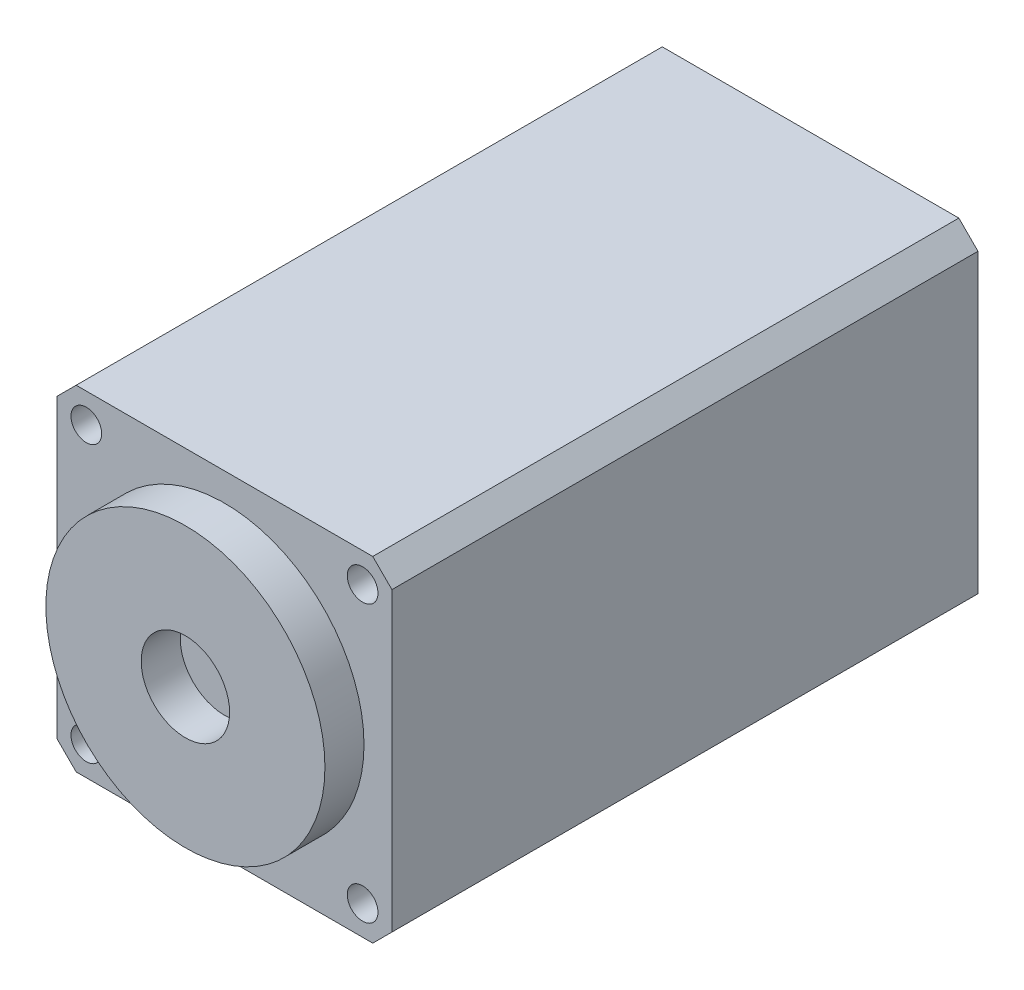
ISO-10303-21;
HEADER;
FILE_DESCRIPTION(('STEP AP214'),'2;1');
FILE_NAME('part.step','',(''),(''),'','','');
FILE_SCHEMA(('AUTOMOTIVE_DESIGN { 1 0 10303 214 1 1 1 1 }'));
ENDSEC;
DATA;
#1=APPLICATION_CONTEXT('core data for automotive mechanical design processes');
#2=APPLICATION_PROTOCOL_DEFINITION('international standard','automotive_design',2000,#1);
#3=PRODUCT_CONTEXT('',#1,'mechanical');
#4=PRODUCT('Part','Part','',(#3));
#5=PRODUCT_RELATED_PRODUCT_CATEGORY('part','',(#4));
#6=PRODUCT_DEFINITION_FORMATION('','',#4);
#7=PRODUCT_DEFINITION_CONTEXT('part definition',#1,'design');
#8=PRODUCT_DEFINITION('design','',#6,#7);
#9=PRODUCT_DEFINITION_SHAPE('','',#8);
#10=(LENGTH_UNIT() NAMED_UNIT(*) SI_UNIT(.MILLI.,.METRE.));
#11=(NAMED_UNIT(*) PLANE_ANGLE_UNIT() SI_UNIT($,.RADIAN.));
#12=(NAMED_UNIT(*) SI_UNIT($,.STERADIAN.) SOLID_ANGLE_UNIT());
#13=UNCERTAINTY_MEASURE_WITH_UNIT(LENGTH_MEASURE(1.E-05),#10,'distance_accuracy_value','');
#14=(GEOMETRIC_REPRESENTATION_CONTEXT(3) GLOBAL_UNCERTAINTY_ASSIGNED_CONTEXT((#13)) GLOBAL_UNIT_ASSIGNED_CONTEXT((#10,
#11,#12)) REPRESENTATION_CONTEXT('',''));
#15=CARTESIAN_POINT('',(0.,0.,0.));
#16=DIRECTION('',(0.,0.,1.));
#17=DIRECTION('',(1.,0.,0.));
#18=AXIS2_PLACEMENT_3D('',#15,#16,#17);
#19=CARTESIAN_POINT('',(0.,30.,105.));
#20=DIRECTION('',(0.,1.,0.));
#21=DIRECTION('',(-1.,0.,0.));
#22=AXIS2_PLACEMENT_3D('',#19,#20,#21);
#23=PLANE('',#22);
#24=DIRECTION('',(1.,0.,0.));
#25=VECTOR('',#24,1.);
#26=CARTESIAN_POINT('',(0.,30.,0.));
#27=LINE('',#26,#25);
#28=CARTESIAN_POINT('',(-26.5685424949238,30.,0.));
#29=VERTEX_POINT('',#28);
#30=CARTESIAN_POINT('',(26.5685424949238,30.,0.));
#31=VERTEX_POINT('',#30);
#32=EDGE_CURVE('E151',#29,#31,#27,.T.);
#33=ORIENTED_EDGE('',*,*,#32,.F.);
#34=DIRECTION('',(0.,0.,-1.));
#35=VECTOR('',#34,1.);
#36=CARTESIAN_POINT('',(-26.5685424949238,30.,105.));
#37=LINE('',#36,#35);
#38=CARTESIAN_POINT('',(-26.5685424949238,30.,105.));
#39=VERTEX_POINT('',#38);
#40=EDGE_CURVE('E47',#39,#29,#37,.T.);
#41=ORIENTED_EDGE('',*,*,#40,.F.);
#42=DIRECTION('',(1.,0.,0.));
#43=VECTOR('',#42,1.);
#44=CARTESIAN_POINT('',(0.,30.,105.));
#45=LINE('',#44,#43);
#46=CARTESIAN_POINT('',(26.5685424949238,30.,105.));
#47=VERTEX_POINT('',#46);
#48=EDGE_CURVE('E297',#39,#47,#45,.T.);
#49=ORIENTED_EDGE('',*,*,#48,.T.);
#50=DIRECTION('',(0.,0.,-1.));
#51=VECTOR('',#50,1.);
#52=CARTESIAN_POINT('',(26.5685424949238,30.,105.));
#53=LINE('',#52,#51);
#54=EDGE_CURVE('E55',#47,#31,#53,.T.);
#55=ORIENTED_EDGE('',*,*,#54,.T.);
#56=EDGE_LOOP('',(#33,#41,#49,#55));
#57=FACE_BOUND('',#56,.T.);
#58=ADVANCED_FACE('F38',(#57),#23,.T.);
#59=CARTESIAN_POINT('',(-28.2842712474619,28.2842712474619,105.));
#60=DIRECTION('',(0.707106781186546,-0.707106781186549,0.));
#61=DIRECTION('',(0.707106781186549,0.707106781186546,0.));
#62=AXIS2_PLACEMENT_3D('',#59,#60,#61);
#63=PLANE('',#62);
#64=DIRECTION('',(-0.707106781186549,-0.707106781186546,0.));
#65=VECTOR('',#64,1.);
#66=CARTESIAN_POINT('',(-28.2842712474619,28.2842712474619,0.));
#67=LINE('',#66,#65);
#68=CARTESIAN_POINT('',(-30.,26.5685424949238,0.));
#69=VERTEX_POINT('',#68);
#70=EDGE_CURVE('E145',#29,#69,#67,.T.);
#71=ORIENTED_EDGE('',*,*,#70,.T.);
#72=DIRECTION('',(0.,0.,-1.));
#73=VECTOR('',#72,1.);
#74=CARTESIAN_POINT('',(-30.,26.5685424949238,105.));
#75=LINE('',#74,#73);
#76=CARTESIAN_POINT('',(-30.,26.5685424949238,105.));
#77=VERTEX_POINT('',#76);
#78=EDGE_CURVE('E139',#77,#69,#75,.T.);
#79=ORIENTED_EDGE('',*,*,#78,.F.);
#80=DIRECTION('',(-0.707106781186549,-0.707106781186546,0.));
#81=VECTOR('',#80,1.);
#82=CARTESIAN_POINT('',(-28.2842712474619,28.2842712474619,105.));
#83=LINE('',#82,#81);
#84=EDGE_CURVE('E147',#39,#77,#83,.T.);
#85=ORIENTED_EDGE('',*,*,#84,.F.);
#86=ORIENTED_EDGE('',*,*,#40,.T.);
#87=EDGE_LOOP('',(#71,#79,#85,#86));
#88=FACE_BOUND('',#87,.T.);
#89=ADVANCED_FACE('F143',(#88),#63,.F.);
#90=CARTESIAN_POINT('',(-30.,0.,105.));
#91=DIRECTION('',(-1.,0.,0.));
#92=DIRECTION('',(0.,0.,1.));
#93=AXIS2_PLACEMENT_3D('',#90,#91,#92);
#94=PLANE('',#93);
#95=DIRECTION('',(0.,1.,0.));
#96=VECTOR('',#95,1.);
#97=CARTESIAN_POINT('',(-30.,0.,0.));
#98=LINE('',#97,#96);
#99=CARTESIAN_POINT('',(-30.,-26.5685424949238,0.));
#100=VERTEX_POINT('',#99);
#101=EDGE_CURVE('E154',#100,#69,#98,.T.);
#102=ORIENTED_EDGE('',*,*,#101,.F.);
#103=DIRECTION('',(0.,0.,-1.));
#104=VECTOR('',#103,1.);
#105=CARTESIAN_POINT('',(-30.,-26.5685424949238,105.));
#106=LINE('',#105,#104);
#107=CARTESIAN_POINT('',(-30.,-26.5685424949238,105.));
#108=VERTEX_POINT('',#107);
#109=EDGE_CURVE('E137',#108,#100,#106,.T.);
#110=ORIENTED_EDGE('',*,*,#109,.F.);
#111=DIRECTION('',(0.,1.,0.));
#112=VECTOR('',#111,1.);
#113=CARTESIAN_POINT('',(-30.,0.,105.));
#114=LINE('',#113,#112);
#115=EDGE_CURVE('E300',#108,#77,#114,.T.);
#116=ORIENTED_EDGE('',*,*,#115,.T.);
#117=ORIENTED_EDGE('',*,*,#78,.T.);
#118=EDGE_LOOP('',(#102,#110,#116,#117));
#119=FACE_BOUND('',#118,.T.);
#120=ADVANCED_FACE('F207',(#119),#94,.T.);
#121=CARTESIAN_POINT('',(-28.2842712474619,-28.2842712474619,105.));
#122=DIRECTION('',(0.707106781186548,0.707106781186548,0.));
#123=DIRECTION('',(-0.707106781186548,0.707106781186548,0.));
#124=AXIS2_PLACEMENT_3D('',#121,#122,#123);
#125=PLANE('',#124);
#126=DIRECTION('',(0.707106781186548,-0.707106781186548,0.));
#127=VECTOR('',#126,1.);
#128=CARTESIAN_POINT('',(-28.2842712474619,-28.2842712474619,0.));
#129=LINE('',#128,#127);
#130=CARTESIAN_POINT('',(-26.5685424949238,-30.,0.));
#131=VERTEX_POINT('',#130);
#132=EDGE_CURVE('E164',#100,#131,#129,.T.);
#133=ORIENTED_EDGE('',*,*,#132,.T.);
#134=DIRECTION('',(0.,0.,-1.));
#135=VECTOR('',#134,1.);
#136=CARTESIAN_POINT('',(-26.5685424949238,-30.,105.));
#137=LINE('',#136,#135);
#138=CARTESIAN_POINT('',(-26.5685424949238,-30.,105.));
#139=VERTEX_POINT('',#138);
#140=EDGE_CURVE('E130',#139,#131,#137,.T.);
#141=ORIENTED_EDGE('',*,*,#140,.F.);
#142=DIRECTION('',(0.707106781186548,-0.707106781186548,0.));
#143=VECTOR('',#142,1.);
#144=CARTESIAN_POINT('',(-28.2842712474619,-28.2842712474619,105.));
#145=LINE('',#144,#143);
#146=EDGE_CURVE('E303',#108,#139,#145,.T.);
#147=ORIENTED_EDGE('',*,*,#146,.F.);
#148=ORIENTED_EDGE('',*,*,#109,.T.);
#149=EDGE_LOOP('',(#133,#141,#147,#148));
#150=FACE_BOUND('',#149,.T.);
#151=ADVANCED_FACE('F212',(#150),#125,.F.);
#152=CARTESIAN_POINT('',(0.,-30.,105.));
#153=DIRECTION('',(0.,1.,0.));
#154=DIRECTION('',(-1.,0.,0.));
#155=AXIS2_PLACEMENT_3D('',#152,#153,#154);
#156=PLANE('',#155);
#157=DIRECTION('',(1.,0.,0.));
#158=VECTOR('',#157,1.);
#159=CARTESIAN_POINT('',(0.,-30.,0.));
#160=LINE('',#159,#158);
#161=CARTESIAN_POINT('',(26.5685424949238,-30.,0.));
#162=VERTEX_POINT('',#161);
#163=EDGE_CURVE('E167',#131,#162,#160,.T.);
#164=ORIENTED_EDGE('',*,*,#163,.T.);
#165=DIRECTION('',(0.,0.,-1.));
#166=VECTOR('',#165,1.);
#167=CARTESIAN_POINT('',(26.5685424949238,-30.,105.));
#168=LINE('',#167,#166);
#169=CARTESIAN_POINT('',(26.5685424949238,-30.,105.));
#170=VERTEX_POINT('',#169);
#171=EDGE_CURVE('E128',#170,#162,#168,.T.);
#172=ORIENTED_EDGE('',*,*,#171,.F.);
#173=DIRECTION('',(1.,0.,0.));
#174=VECTOR('',#173,1.);
#175=CARTESIAN_POINT('',(0.,-30.,105.));
#176=LINE('',#175,#174);
#177=EDGE_CURVE('E121',#139,#170,#176,.T.);
#178=ORIENTED_EDGE('',*,*,#177,.F.);
#179=ORIENTED_EDGE('',*,*,#140,.T.);
#180=EDGE_LOOP('',(#164,#172,#178,#179));
#181=FACE_BOUND('',#180,.T.);
#182=ADVANCED_FACE('F216',(#181),#156,.F.);
#183=CARTESIAN_POINT('',(28.2842712474619,-28.2842712474619,105.));
#184=DIRECTION('',(-0.707106781186547,0.707106781186548,0.));
#185=DIRECTION('',(-0.707106781186548,-0.707106781186547,0.));
#186=AXIS2_PLACEMENT_3D('',#183,#184,#185);
#187=PLANE('',#186);
#188=DIRECTION('',(0.707106781186548,0.707106781186547,0.));
#189=VECTOR('',#188,1.);
#190=CARTESIAN_POINT('',(28.2842712474619,-28.2842712474619,0.));
#191=LINE('',#190,#189);
#192=CARTESIAN_POINT('',(30.,-26.5685424949238,0.));
#193=VERTEX_POINT('',#192);
#194=EDGE_CURVE('E127',#162,#193,#191,.T.);
#195=ORIENTED_EDGE('',*,*,#194,.T.);
#196=DIRECTION('',(0.,0.,-1.));
#197=VECTOR('',#196,1.);
#198=CARTESIAN_POINT('',(30.,-26.5685424949238,105.));
#199=LINE('',#198,#197);
#200=CARTESIAN_POINT('',(30.,-26.5685424949238,105.));
#201=VERTEX_POINT('',#200);
#202=EDGE_CURVE('E110',#201,#193,#199,.T.);
#203=ORIENTED_EDGE('',*,*,#202,.F.);
#204=DIRECTION('',(0.707106781186548,0.707106781186547,0.));
#205=VECTOR('',#204,1.);
#206=CARTESIAN_POINT('',(28.2842712474619,-28.2842712474619,105.));
#207=LINE('',#206,#205);
#208=EDGE_CURVE('E115',#170,#201,#207,.T.);
#209=ORIENTED_EDGE('',*,*,#208,.F.);
#210=ORIENTED_EDGE('',*,*,#171,.T.);
#211=EDGE_LOOP('',(#195,#203,#209,#210));
#212=FACE_BOUND('',#211,.T.);
#213=ADVANCED_FACE('F126',(#212),#187,.F.);
#214=CARTESIAN_POINT('',(30.,0.,105.));
#215=DIRECTION('',(-1.,0.,0.));
#216=DIRECTION('',(0.,0.,1.));
#217=AXIS2_PLACEMENT_3D('',#214,#215,#216);
#218=PLANE('',#217);
#219=DIRECTION('',(0.,1.,0.));
#220=VECTOR('',#219,1.);
#221=CARTESIAN_POINT('',(30.,0.,0.));
#222=LINE('',#221,#220);
#223=CARTESIAN_POINT('',(30.,26.5685424949238,0.));
#224=VERTEX_POINT('',#223);
#225=EDGE_CURVE('E171',#193,#224,#222,.T.);
#226=ORIENTED_EDGE('',*,*,#225,.T.);
#227=DIRECTION('',(0.,0.,-1.));
#228=VECTOR('',#227,1.);
#229=CARTESIAN_POINT('',(30.,26.5685424949238,105.));
#230=LINE('',#229,#228);
#231=CARTESIAN_POINT('',(30.,26.5685424949238,105.));
#232=VERTEX_POINT('',#231);
#233=EDGE_CURVE('E82',#232,#224,#230,.T.);
#234=ORIENTED_EDGE('',*,*,#233,.F.);
#235=DIRECTION('',(0.,1.,0.));
#236=VECTOR('',#235,1.);
#237=CARTESIAN_POINT('',(30.,0.,105.));
#238=LINE('',#237,#236);
#239=EDGE_CURVE('E106',#201,#232,#238,.T.);
#240=ORIENTED_EDGE('',*,*,#239,.F.);
#241=ORIENTED_EDGE('',*,*,#202,.T.);
#242=EDGE_LOOP('',(#226,#234,#240,#241));
#243=FACE_BOUND('',#242,.T.);
#244=ADVANCED_FACE('F108',(#243),#218,.F.);
#245=CARTESIAN_POINT('',(-24.7487373415292,24.7487373415292,105.));
#246=DIRECTION('',(0.,0.,-1.));
#247=DIRECTION('',(-1.,0.,0.));
#248=AXIS2_PLACEMENT_3D('',#245,#246,#247);
#249=CYLINDRICAL_SURFACE('',#248,2.75);
#250=CARTESIAN_POINT('',(-24.7487373415292,24.7487373415292,105.));
#251=DIRECTION('',(0.,0.,1.));
#252=DIRECTION('',(1.,0.,0.));
#253=AXIS2_PLACEMENT_3D('',#250,#251,#252);
#254=CIRCLE('',#253,2.75);
#255=CARTESIAN_POINT('',(-21.9987373415292,24.7487373415292,105.));
#256=VERTEX_POINT('',#255);
#257=EDGE_CURVE('E294',#256,#256,#254,.T.);
#258=ORIENTED_EDGE('',*,*,#257,.T.);
#259=EDGE_LOOP('',(#258));
#260=FACE_BOUND('',#259,.T.);
#261=CARTESIAN_POINT('',(-24.7487373415292,24.7487373415292,0.));
#262=DIRECTION('',(0.,0.,1.));
#263=DIRECTION('',(1.,0.,0.));
#264=AXIS2_PLACEMENT_3D('',#261,#262,#263);
#265=CIRCLE('',#264,2.75);
#266=CARTESIAN_POINT('',(-21.9987373415292,24.7487373415292,0.));
#267=VERTEX_POINT('',#266);
#268=EDGE_CURVE('E156',#267,#267,#265,.T.);
#269=ORIENTED_EDGE('',*,*,#268,.F.);
#270=EDGE_LOOP('',(#269));
#271=FACE_BOUND('',#270,.T.);
#272=ADVANCED_FACE('F191',(#260,#271),#249,.F.);
#273=CARTESIAN_POINT('',(24.7487373415291,24.7487373415292,105.));
#274=DIRECTION('',(0.,0.,-1.));
#275=DIRECTION('',(-1.,0.,0.));
#276=AXIS2_PLACEMENT_3D('',#273,#274,#275);
#277=CYLINDRICAL_SURFACE('',#276,2.75);
#278=CARTESIAN_POINT('',(24.7487373415291,24.7487373415292,105.));
#279=DIRECTION('',(0.,0.,1.));
#280=DIRECTION('',(1.,0.,0.));
#281=AXIS2_PLACEMENT_3D('',#278,#279,#280);
#282=CIRCLE('',#281,2.75);
#283=CARTESIAN_POINT('',(27.4987373415291,24.7487373415292,105.));
#284=VERTEX_POINT('',#283);
#285=EDGE_CURVE('E292',#284,#284,#282,.T.);
#286=ORIENTED_EDGE('',*,*,#285,.T.);
#287=EDGE_LOOP('',(#286));
#288=FACE_BOUND('',#287,.T.);
#289=CARTESIAN_POINT('',(24.7487373415291,24.7487373415292,0.));
#290=DIRECTION('',(0.,0.,1.));
#291=DIRECTION('',(1.,0.,0.));
#292=AXIS2_PLACEMENT_3D('',#289,#290,#291);
#293=CIRCLE('',#292,2.75);
#294=CARTESIAN_POINT('',(27.4987373415291,24.7487373415292,0.));
#295=VERTEX_POINT('',#294);
#296=EDGE_CURVE('E159',#295,#295,#293,.T.);
#297=ORIENTED_EDGE('',*,*,#296,.F.);
#298=EDGE_LOOP('',(#297));
#299=FACE_BOUND('',#298,.T.);
#300=ADVANCED_FACE('F188',(#288,#299),#277,.F.);
#301=CARTESIAN_POINT('',(-24.7487373415292,-24.7487373415292,105.));
#302=DIRECTION('',(0.,0.,-1.));
#303=DIRECTION('',(-1.,0.,0.));
#304=AXIS2_PLACEMENT_3D('',#301,#302,#303);
#305=CYLINDRICAL_SURFACE('',#304,2.75);
#306=CARTESIAN_POINT('',(-24.7487373415292,-24.7487373415292,105.));
#307=DIRECTION('',(0.,0.,1.));
#308=DIRECTION('',(1.,0.,0.));
#309=AXIS2_PLACEMENT_3D('',#306,#307,#308);
#310=CIRCLE('',#309,2.75);
#311=CARTESIAN_POINT('',(-21.9987373415292,-24.7487373415292,105.));
#312=VERTEX_POINT('',#311);
#313=EDGE_CURVE('E289',#312,#312,#310,.T.);
#314=ORIENTED_EDGE('',*,*,#313,.T.);
#315=EDGE_LOOP('',(#314));
#316=FACE_BOUND('',#315,.T.);
#317=CARTESIAN_POINT('',(-24.7487373415292,-24.7487373415292,0.));
#318=DIRECTION('',(0.,0.,1.));
#319=DIRECTION('',(1.,0.,0.));
#320=AXIS2_PLACEMENT_3D('',#317,#318,#319);
#321=CIRCLE('',#320,2.75);
#322=CARTESIAN_POINT('',(-21.9987373415292,-24.7487373415292,0.));
#323=VERTEX_POINT('',#322);
#324=EDGE_CURVE('E180',#323,#323,#321,.T.);
#325=ORIENTED_EDGE('',*,*,#324,.F.);
#326=EDGE_LOOP('',(#325));
#327=FACE_BOUND('',#326,.T.);
#328=ADVANCED_FACE('F190',(#316,#327),#305,.F.);
#329=CARTESIAN_POINT('',(24.7487373415292,-24.7487373415292,105.));
#330=DIRECTION('',(0.,0.,-1.));
#331=DIRECTION('',(-1.,0.,0.));
#332=AXIS2_PLACEMENT_3D('',#329,#330,#331);
#333=CYLINDRICAL_SURFACE('',#332,2.75);
#334=CARTESIAN_POINT('',(24.7487373415292,-24.7487373415292,105.));
#335=DIRECTION('',(0.,0.,1.));
#336=DIRECTION('',(1.,0.,0.));
#337=AXIS2_PLACEMENT_3D('',#334,#335,#336);
#338=CIRCLE('',#337,2.75);
#339=CARTESIAN_POINT('',(27.4987373415292,-24.7487373415292,105.));
#340=VERTEX_POINT('',#339);
#341=EDGE_CURVE('E174',#340,#340,#338,.T.);
#342=ORIENTED_EDGE('',*,*,#341,.T.);
#343=EDGE_LOOP('',(#342));
#344=FACE_BOUND('',#343,.T.);
#345=CARTESIAN_POINT('',(24.7487373415292,-24.7487373415292,0.));
#346=DIRECTION('',(0.,0.,1.));
#347=DIRECTION('',(1.,0.,0.));
#348=AXIS2_PLACEMENT_3D('',#345,#346,#347);
#349=CIRCLE('',#348,2.75);
#350=CARTESIAN_POINT('',(27.4987373415292,-24.7487373415292,0.));
#351=VERTEX_POINT('',#350);
#352=EDGE_CURVE('E177',#351,#351,#349,.T.);
#353=ORIENTED_EDGE('',*,*,#352,.F.);
#354=EDGE_LOOP('',(#353));
#355=FACE_BOUND('',#354,.T.);
#356=ADVANCED_FACE('F40',(#344,#355),#333,.F.);
#357=CARTESIAN_POINT('',(28.2842712474619,28.2842712474619,105.));
#358=DIRECTION('',(0.707106781186547,0.707106781186548,0.));
#359=DIRECTION('',(-0.707106781186548,0.707106781186547,0.));
#360=AXIS2_PLACEMENT_3D('',#357,#358,#359);
#361=PLANE('',#360);
#362=DIRECTION('',(0.707106781186548,-0.707106781186547,0.));
#363=VECTOR('',#362,1.);
#364=CARTESIAN_POINT('',(28.2842712474619,28.2842712474619,0.));
#365=LINE('',#364,#363);
#366=EDGE_CURVE('E173',#31,#224,#365,.T.);
#367=ORIENTED_EDGE('',*,*,#366,.F.);
#368=ORIENTED_EDGE('',*,*,#54,.F.);
#369=DIRECTION('',(0.707106781186548,-0.707106781186547,0.));
#370=VECTOR('',#369,1.);
#371=CARTESIAN_POINT('',(28.2842712474619,28.2842712474619,105.));
#372=LINE('',#371,#370);
#373=EDGE_CURVE('E114',#47,#232,#372,.T.);
#374=ORIENTED_EDGE('',*,*,#373,.T.);
#375=ORIENTED_EDGE('',*,*,#233,.T.);
#376=EDGE_LOOP('',(#367,#368,#374,#375));
#377=FACE_BOUND('',#376,.T.);
#378=ADVANCED_FACE('F225',(#377),#361,.T.);
#379=CARTESIAN_POINT('',(0.,0.,105.));
#380=DIRECTION('',(0.,0.,1.));
#381=DIRECTION('',(1.,0.,0.));
#382=AXIS2_PLACEMENT_3D('',#379,#380,#381);
#383=PLANE('',#382);
#384=CARTESIAN_POINT('',(0.,0.,105.));
#385=DIRECTION('',(0.,0.,1.));
#386=DIRECTION('',(1.,0.,0.));
#387=AXIS2_PLACEMENT_3D('',#384,#385,#386);
#388=CIRCLE('',#387,25.);
#389=CARTESIAN_POINT('',(25.,0.,105.));
#390=VERTEX_POINT('',#389);
#391=EDGE_CURVE('E282',#390,#390,#388,.T.);
#392=ORIENTED_EDGE('',*,*,#391,.F.);
#393=EDGE_LOOP('',(#392));
#394=FACE_BOUND('',#393,.T.);
#395=ORIENTED_EDGE('',*,*,#341,.F.);
#396=EDGE_LOOP('',(#395));
#397=FACE_BOUND('',#396,.T.);
#398=ORIENTED_EDGE('',*,*,#313,.F.);
#399=EDGE_LOOP('',(#398));
#400=FACE_BOUND('',#399,.T.);
#401=ORIENTED_EDGE('',*,*,#285,.F.);
#402=EDGE_LOOP('',(#401));
#403=FACE_BOUND('',#402,.T.);
#404=ORIENTED_EDGE('',*,*,#257,.F.);
#405=EDGE_LOOP('',(#404));
#406=FACE_BOUND('',#405,.T.);
#407=ORIENTED_EDGE('',*,*,#48,.F.);
#408=ORIENTED_EDGE('',*,*,#84,.T.);
#409=ORIENTED_EDGE('',*,*,#115,.F.);
#410=ORIENTED_EDGE('',*,*,#146,.T.);
#411=ORIENTED_EDGE('',*,*,#177,.T.);
#412=ORIENTED_EDGE('',*,*,#208,.T.);
#413=ORIENTED_EDGE('',*,*,#239,.T.);
#414=ORIENTED_EDGE('',*,*,#373,.F.);
#415=EDGE_LOOP('',(#407,#408,#409,#410,#411,#412,#413,#414));
#416=FACE_BOUND('',#415,.T.);
#417=ADVANCED_FACE('F119',(#394,#397,#400,#403,#406,#416),#383,.T.);
#418=CARTESIAN_POINT('',(0.,0.,0.));
#419=DIRECTION('',(0.,0.,1.));
#420=DIRECTION('',(1.,0.,0.));
#421=AXIS2_PLACEMENT_3D('',#418,#419,#420);
#422=PLANE('',#421);
#423=CARTESIAN_POINT('',(0.,0.,0.));
#424=DIRECTION('',(0.,0.,-1.));
#425=DIRECTION('',(-1.,0.,0.));
#426=AXIS2_PLACEMENT_3D('',#423,#424,#425);
#427=CIRCLE('',#426,25.);
#428=CARTESIAN_POINT('',(-25.,0.,0.));
#429=VERTEX_POINT('',#428);
#430=EDGE_CURVE('E271',#429,#429,#427,.T.);
#431=ORIENTED_EDGE('',*,*,#430,.F.);
#432=EDGE_LOOP('',(#431));
#433=FACE_BOUND('',#432,.T.);
#434=ORIENTED_EDGE('',*,*,#352,.T.);
#435=EDGE_LOOP('',(#434));
#436=FACE_BOUND('',#435,.T.);
#437=ORIENTED_EDGE('',*,*,#324,.T.);
#438=EDGE_LOOP('',(#437));
#439=FACE_BOUND('',#438,.T.);
#440=ORIENTED_EDGE('',*,*,#296,.T.);
#441=EDGE_LOOP('',(#440));
#442=FACE_BOUND('',#441,.T.);
#443=ORIENTED_EDGE('',*,*,#268,.T.);
#444=EDGE_LOOP('',(#443));
#445=FACE_BOUND('',#444,.T.);
#446=ORIENTED_EDGE('',*,*,#32,.T.);
#447=ORIENTED_EDGE('',*,*,#366,.T.);
#448=ORIENTED_EDGE('',*,*,#225,.F.);
#449=ORIENTED_EDGE('',*,*,#194,.F.);
#450=ORIENTED_EDGE('',*,*,#163,.F.);
#451=ORIENTED_EDGE('',*,*,#132,.F.);
#452=ORIENTED_EDGE('',*,*,#101,.T.);
#453=ORIENTED_EDGE('',*,*,#70,.F.);
#454=EDGE_LOOP('',(#446,#447,#448,#449,#450,#451,#452,#453));
#455=FACE_BOUND('',#454,.T.);
#456=ADVANCED_FACE('F149',(#433,#436,#439,#442,#445,#455),#422,.F.);
#457=CARTESIAN_POINT('',(0.,0.,112.));
#458=DIRECTION('',(0.,0.,1.));
#459=DIRECTION('',(1.,0.,0.));
#460=AXIS2_PLACEMENT_3D('',#457,#458,#459);
#461=PLANE('',#460);
#462=CARTESIAN_POINT('',(0.,0.,112.));
#463=DIRECTION('',(0.,0.,1.));
#464=DIRECTION('',(1.,0.,0.));
#465=AXIS2_PLACEMENT_3D('',#462,#463,#464);
#466=CIRCLE('',#465,25.);
#467=CARTESIAN_POINT('',(25.,0.,112.));
#468=VERTEX_POINT('',#467);
#469=EDGE_CURVE('E181',#468,#468,#466,.T.);
#470=ORIENTED_EDGE('',*,*,#469,.T.);
#471=EDGE_LOOP('',(#470));
#472=FACE_BOUND('',#471,.T.);
#473=CARTESIAN_POINT('',(0.,0.,112.));
#474=DIRECTION('',(0.,0.,1.));
#475=DIRECTION('',(1.,0.,0.));
#476=AXIS2_PLACEMENT_3D('',#473,#474,#475);
#477=CIRCLE('',#476,7.9202183345015);
#478=CARTESIAN_POINT('',(7.9202183345015,0.,112.));
#479=VERTEX_POINT('',#478);
#480=EDGE_CURVE('E277',#479,#479,#477,.T.);
#481=ORIENTED_EDGE('',*,*,#480,.F.);
#482=EDGE_LOOP('',(#481));
#483=FACE_BOUND('',#482,.T.);
#484=ADVANCED_FACE('F230',(#472,#483),#461,.T.);
#485=CARTESIAN_POINT('',(0.,0.,112.));
#486=DIRECTION('',(0.,0.,-1.));
#487=DIRECTION('',(-1.,0.,0.));
#488=AXIS2_PLACEMENT_3D('',#485,#486,#487);
#489=CYLINDRICAL_SURFACE('',#488,25.);
#490=ORIENTED_EDGE('',*,*,#469,.F.);
#491=EDGE_LOOP('',(#490));
#492=FACE_BOUND('',#491,.T.);
#493=ORIENTED_EDGE('',*,*,#391,.T.);
#494=EDGE_LOOP('',(#493));
#495=FACE_BOUND('',#494,.T.);
#496=ADVANCED_FACE('F236',(#492,#495),#489,.T.);
#497=CARTESIAN_POINT('',(0.,0.,112.));
#498=DIRECTION('',(0.,0.,-1.));
#499=DIRECTION('',(-1.,0.,0.));
#500=AXIS2_PLACEMENT_3D('',#497,#498,#499);
#501=CYLINDRICAL_SURFACE('',#500,7.9202183345015);
#502=ORIENTED_EDGE('',*,*,#480,.T.);
#503=EDGE_LOOP('',(#502));
#504=FACE_BOUND('',#503,.T.);
#505=CARTESIAN_POINT('',(0.,0.,105.));
#506=DIRECTION('',(0.,0.,1.));
#507=DIRECTION('',(1.,0.,0.));
#508=AXIS2_PLACEMENT_3D('',#505,#506,#507);
#509=CIRCLE('',#508,7.9202183345015);
#510=CARTESIAN_POINT('',(7.9202183345015,0.,105.));
#511=VERTEX_POINT('',#510);
#512=EDGE_CURVE('E11',#511,#511,#509,.F.);
#513=ORIENTED_EDGE('',*,*,#512,.T.);
#514=EDGE_LOOP('',(#513));
#515=FACE_BOUND('',#514,.T.);
#516=ADVANCED_FACE('F239',(#504,#515),#501,.F.);
#517=ORIENTED_EDGE('',*,*,#512,.F.);
#518=EDGE_LOOP('',(#517));
#519=FACE_BOUND('',#518,.T.);
#520=ADVANCED_FACE('F235',(#519),#383,.T.);
#521=CARTESIAN_POINT('',(0.,0.,6.));
#522=DIRECTION('',(0.,0.,-1.));
#523=DIRECTION('',(-1.,0.,0.));
#524=AXIS2_PLACEMENT_3D('',#521,#522,#523);
#525=CYLINDRICAL_SURFACE('',#524,25.);
#526=CARTESIAN_POINT('',(0.,0.,6.));
#527=DIRECTION('',(0.,0.,-1.));
#528=DIRECTION('',(-1.,0.,0.));
#529=AXIS2_PLACEMENT_3D('',#526,#527,#528);
#530=CIRCLE('',#529,25.);
#531=CARTESIAN_POINT('',(-25.,0.,6.));
#532=VERTEX_POINT('',#531);
#533=EDGE_CURVE('E274',#532,#532,#530,.T.);
#534=ORIENTED_EDGE('',*,*,#533,.F.);
#535=EDGE_LOOP('',(#534));
#536=FACE_BOUND('',#535,.T.);
#537=ORIENTED_EDGE('',*,*,#430,.T.);
#538=EDGE_LOOP('',(#537));
#539=FACE_BOUND('',#538,.T.);
#540=ADVANCED_FACE('F247',(#536,#539),#525,.F.);
#541=CARTESIAN_POINT('',(0.,0.,6.));
#542=DIRECTION('',(0.,0.,-1.));
#543=DIRECTION('',(-1.,0.,0.));
#544=AXIS2_PLACEMENT_3D('',#541,#542,#543);
#545=PLANE('',#544);
#546=CARTESIAN_POINT('',(0.,0.,6.));
#547=DIRECTION('',(0.,0.,-1.));
#548=DIRECTION('',(-1.,0.,0.));
#549=AXIS2_PLACEMENT_3D('',#546,#547,#548);
#550=CIRCLE('',#549,7.);
#551=CARTESIAN_POINT('',(-7.,0.,6.));
#552=VERTEX_POINT('',#551);
#553=EDGE_CURVE('E268',#552,#552,#550,.T.);
#554=ORIENTED_EDGE('',*,*,#553,.F.);
#555=EDGE_LOOP('',(#554));
#556=FACE_BOUND('',#555,.T.);
#557=ORIENTED_EDGE('',*,*,#533,.T.);
#558=EDGE_LOOP('',(#557));
#559=FACE_BOUND('',#558,.T.);
#560=ADVANCED_FACE('F250',(#556,#559),#545,.T.);
#561=CARTESIAN_POINT('',(0.,0.,34.));
#562=DIRECTION('',(0.,0.,-1.));
#563=DIRECTION('',(-1.,0.,0.));
#564=AXIS2_PLACEMENT_3D('',#561,#562,#563);
#565=CYLINDRICAL_SURFACE('',#564,7.);
#566=ORIENTED_EDGE('',*,*,#553,.T.);
#567=EDGE_LOOP('',(#566));
#568=FACE_BOUND('',#567,.T.);
#569=CARTESIAN_POINT('',(0.,0.,34.));
#570=DIRECTION('',(0.,0.,-1.));
#571=DIRECTION('',(-1.,0.,0.));
#572=AXIS2_PLACEMENT_3D('',#569,#570,#571);
#573=CIRCLE('',#572,7.);
#574=CARTESIAN_POINT('',(-7.,0.,34.));
#575=VERTEX_POINT('',#574);
#576=EDGE_CURVE('E266',#575,#575,#573,.T.);
#577=ORIENTED_EDGE('',*,*,#576,.F.);
#578=EDGE_LOOP('',(#577));
#579=FACE_BOUND('',#578,.T.);
#580=ADVANCED_FACE('F254',(#568,#579),#565,.F.);
#581=CARTESIAN_POINT('',(0.,0.,34.));
#582=DIRECTION('',(0.,0.,-1.));
#583=DIRECTION('',(-1.,0.,0.));
#584=AXIS2_PLACEMENT_3D('',#581,#582,#583);
#585=PLANE('',#584);
#586=ORIENTED_EDGE('',*,*,#576,.T.);
#587=EDGE_LOOP('',(#586));
#588=FACE_BOUND('',#587,.T.);
#589=ADVANCED_FACE('F258',(#588),#585,.T.);
#590=CLOSED_SHELL('',(#58,#89,#120,#151,#182,#213,#244,#272,#300,#328,#356,#378,#417,#456,#484,
#496,#516,#520,#540,#560,#580,#589));
#591=MANIFOLD_SOLID_BREP('B2',#590);
#592=ADVANCED_BREP_SHAPE_REPRESENTATION('',(#18,#591),#14);
#593=SHAPE_DEFINITION_REPRESENTATION(#9,#592);
ENDSEC;
END-ISO-10303-21;
